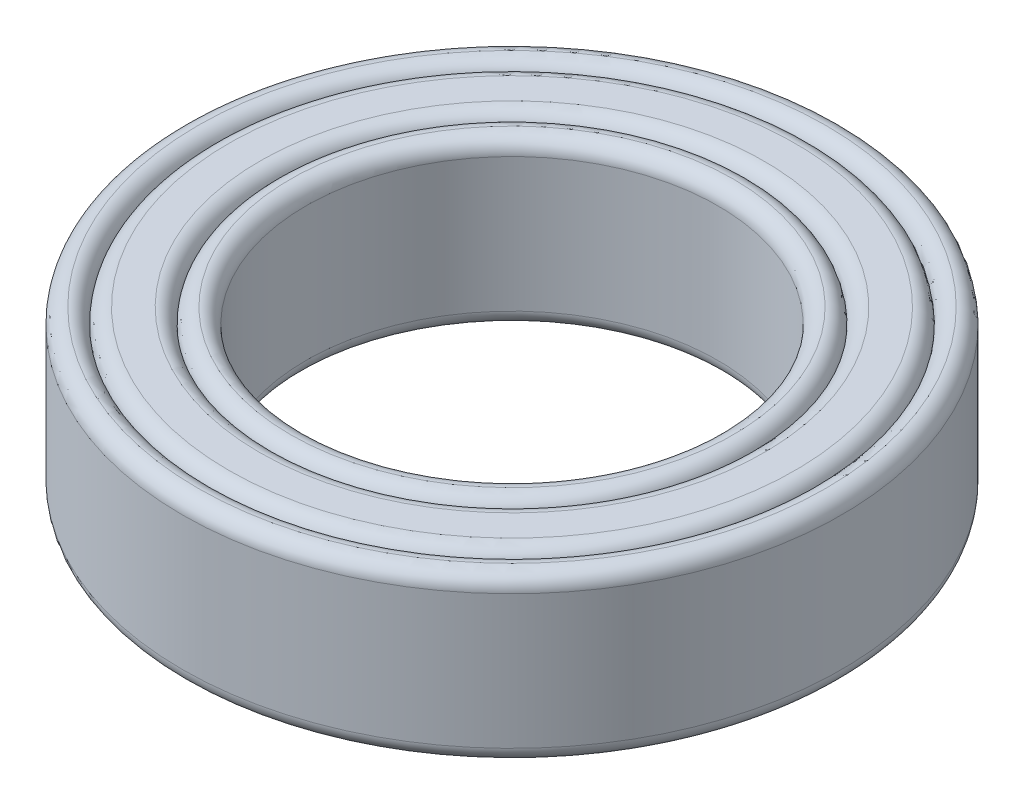
ISO-10303-21;
HEADER;
FILE_DESCRIPTION(('STEP AP214'),'2;1');
FILE_NAME('part.step','',(''),(''),'','','');
FILE_SCHEMA(('AUTOMOTIVE_DESIGN { 1 0 10303 214 1 1 1 1 }'));
ENDSEC;
DATA;
#1=APPLICATION_CONTEXT('core data for automotive mechanical design processes');
#2=APPLICATION_PROTOCOL_DEFINITION('international standard','automotive_design',2000,#1);
#3=PRODUCT_CONTEXT('',#1,'mechanical');
#4=PRODUCT('Part','Part','',(#3));
#5=PRODUCT_RELATED_PRODUCT_CATEGORY('part','',(#4));
#6=PRODUCT_DEFINITION_FORMATION('','',#4);
#7=PRODUCT_DEFINITION_CONTEXT('part definition',#1,'design');
#8=PRODUCT_DEFINITION('design','',#6,#7);
#9=PRODUCT_DEFINITION_SHAPE('','',#8);
#10=(LENGTH_UNIT() NAMED_UNIT(*) SI_UNIT(.MILLI.,.METRE.));
#11=(NAMED_UNIT(*) PLANE_ANGLE_UNIT() SI_UNIT($,.RADIAN.));
#12=(NAMED_UNIT(*) SI_UNIT($,.STERADIAN.) SOLID_ANGLE_UNIT());
#13=UNCERTAINTY_MEASURE_WITH_UNIT(LENGTH_MEASURE(1.E-05),#10,'distance_accuracy_value','');
#14=(GEOMETRIC_REPRESENTATION_CONTEXT(3) GLOBAL_UNCERTAINTY_ASSIGNED_CONTEXT((#13)) GLOBAL_UNIT_ASSIGNED_CONTEXT((#10,
#11,#12)) REPRESENTATION_CONTEXT('',''));
#15=CARTESIAN_POINT('',(0.,0.,0.));
#16=DIRECTION('',(0.,0.,1.));
#17=DIRECTION('',(1.,0.,0.));
#18=AXIS2_PLACEMENT_3D('',#15,#16,#17);
#19=CARTESIAN_POINT('',(0.,2.,0.));
#20=DIRECTION('',(0.,-1.,0.));
#21=DIRECTION('',(0.,0.,-1.));
#22=AXIS2_PLACEMENT_3D('',#19,#20,#21);
#23=CYLINDRICAL_SURFACE('',#22,8.);
#24=CARTESIAN_POINT('',(0.,-1.625,0.));
#25=DIRECTION('',(0.,1.,0.));
#26=DIRECTION('',(0.,0.,1.));
#27=AXIS2_PLACEMENT_3D('',#24,#25,#26);
#28=CIRCLE('',#27,8.);
#29=CARTESIAN_POINT('',(0.,-1.625,8.));
#30=VERTEX_POINT('',#29);
#31=EDGE_CURVE('E83',#30,#30,#28,.T.);
#32=ORIENTED_EDGE('',*,*,#31,.T.);
#33=EDGE_LOOP('',(#32));
#34=FACE_BOUND('',#33,.T.);
#35=CARTESIAN_POINT('',(0.,1.625,0.));
#36=DIRECTION('',(0.,1.,0.));
#37=DIRECTION('',(0.,0.,1.));
#38=AXIS2_PLACEMENT_3D('',#35,#36,#37);
#39=CIRCLE('',#38,8.);
#40=CARTESIAN_POINT('',(0.,1.625,8.));
#41=VERTEX_POINT('',#40);
#42=EDGE_CURVE('E86',#41,#41,#39,.F.);
#43=ORIENTED_EDGE('',*,*,#42,.T.);
#44=EDGE_LOOP('',(#43));
#45=FACE_BOUND('',#44,.T.);
#46=ADVANCED_FACE('F33',(#34,#45),#23,.T.);
#47=CARTESIAN_POINT('',(0.,-1.625,0.));
#48=DIRECTION('',(0.,1.,0.));
#49=DIRECTION('',(0.,0.,1.));
#50=AXIS2_PLACEMENT_3D('',#47,#48,#49);
#51=TOROIDAL_SURFACE('',#50,7.625,0.375);
#52=CARTESIAN_POINT('',(0.,-2.,0.));
#53=DIRECTION('',(0.,1.,0.));
#54=DIRECTION('',(0.,0.,1.));
#55=AXIS2_PLACEMENT_3D('',#52,#53,#54);
#56=CIRCLE('',#55,7.625);
#57=CARTESIAN_POINT('',(0.,-2.,7.625));
#58=VERTEX_POINT('',#57);
#59=EDGE_CURVE('E80',#58,#58,#56,.F.);
#60=ORIENTED_EDGE('',*,*,#59,.F.);
#61=EDGE_LOOP('',(#60));
#62=FACE_BOUND('',#61,.T.);
#63=ORIENTED_EDGE('',*,*,#31,.F.);
#64=EDGE_LOOP('',(#63));
#65=FACE_BOUND('',#64,.T.);
#66=ADVANCED_FACE('F95',(#62,#65),#51,.T.);
#67=CARTESIAN_POINT('',(0.,1.625,0.));
#68=DIRECTION('',(0.,1.,0.));
#69=DIRECTION('',(0.,0.,1.));
#70=AXIS2_PLACEMENT_3D('',#67,#68,#69);
#71=TOROIDAL_SURFACE('',#70,7.625,0.375);
#72=ORIENTED_EDGE('',*,*,#42,.F.);
#73=EDGE_LOOP('',(#72));
#74=FACE_BOUND('',#73,.T.);
#75=CARTESIAN_POINT('',(0.,2.,0.));
#76=DIRECTION('',(0.,1.,0.));
#77=DIRECTION('',(0.,0.,1.));
#78=AXIS2_PLACEMENT_3D('',#75,#76,#77);
#79=CIRCLE('',#78,7.625);
#80=CARTESIAN_POINT('',(0.,2.,7.625));
#81=VERTEX_POINT('',#80);
#82=EDGE_CURVE('E77',#81,#81,#79,.T.);
#83=ORIENTED_EDGE('',*,*,#82,.F.);
#84=EDGE_LOOP('',(#83));
#85=FACE_BOUND('',#84,.T.);
#86=ADVANCED_FACE('F91',(#74,#85),#71,.T.);
#87=CARTESIAN_POINT('',(0.,1.625,0.));
#88=DIRECTION('',(0.,1.,0.));
#89=DIRECTION('',(0.,0.,1.));
#90=AXIS2_PLACEMENT_3D('',#87,#88,#89);
#91=TOROIDAL_SURFACE('',#90,7.625,0.375);
#92=ORIENTED_EDGE('',*,*,#82,.T.);
#93=EDGE_LOOP('',(#92));
#94=FACE_BOUND('',#93,.T.);
#95=CARTESIAN_POINT('',(0.,1.625,0.));
#96=DIRECTION('',(0.,1.,0.));
#97=DIRECTION('',(0.,0.,1.));
#98=AXIS2_PLACEMENT_3D('',#95,#96,#97);
#99=CIRCLE('',#98,7.25);
#100=CARTESIAN_POINT('',(0.,1.625,7.25));
#101=VERTEX_POINT('',#100);
#102=EDGE_CURVE('E71',#101,#101,#99,.T.);
#103=ORIENTED_EDGE('',*,*,#102,.F.);
#104=EDGE_LOOP('',(#103));
#105=FACE_BOUND('',#104,.T.);
#106=ADVANCED_FACE('F94',(#94,#105),#91,.T.);
#107=CARTESIAN_POINT('',(0.,-1.625,0.));
#108=DIRECTION('',(0.,1.,0.));
#109=DIRECTION('',(0.,0.,1.));
#110=AXIS2_PLACEMENT_3D('',#107,#108,#109);
#111=TOROIDAL_SURFACE('',#110,7.625,0.375);
#112=CARTESIAN_POINT('',(0.,-1.625,0.));
#113=DIRECTION('',(0.,1.,0.));
#114=DIRECTION('',(0.,0.,1.));
#115=AXIS2_PLACEMENT_3D('',#112,#113,#114);
#116=CIRCLE('',#115,7.25);
#117=CARTESIAN_POINT('',(0.,-1.625,7.25));
#118=VERTEX_POINT('',#117);
#119=EDGE_CURVE('E74',#118,#118,#116,.F.);
#120=ORIENTED_EDGE('',*,*,#119,.F.);
#121=EDGE_LOOP('',(#120));
#122=FACE_BOUND('',#121,.T.);
#123=ORIENTED_EDGE('',*,*,#59,.T.);
#124=EDGE_LOOP('',(#123));
#125=FACE_BOUND('',#124,.T.);
#126=ADVANCED_FACE('F101',(#122,#125),#111,.T.);
#127=CARTESIAN_POINT('',(0.,-2.,0.));
#128=DIRECTION('',(0.,1.,0.));
#129=DIRECTION('',(0.,0.,1.));
#130=AXIS2_PLACEMENT_3D('',#127,#128,#129);
#131=PLANE('',#130);
#132=CARTESIAN_POINT('',(0.,-2.,0.));
#133=DIRECTION('',(0.,1.,0.));
#134=DIRECTION('',(0.,0.,1.));
#135=AXIS2_PLACEMENT_3D('',#132,#133,#134);
#136=CIRCLE('',#135,6.125);
#137=CARTESIAN_POINT('',(0.,-2.,6.125));
#138=VERTEX_POINT('',#137);
#139=EDGE_CURVE('E53',#138,#138,#136,.T.);
#140=ORIENTED_EDGE('',*,*,#139,.T.);
#141=EDGE_LOOP('',(#140));
#142=FACE_BOUND('',#141,.T.);
#143=CARTESIAN_POINT('',(0.,-2.,0.));
#144=DIRECTION('',(0.,1.,0.));
#145=DIRECTION('',(0.,0.,1.));
#146=AXIS2_PLACEMENT_3D('',#143,#144,#145);
#147=CIRCLE('',#146,6.875);
#148=CARTESIAN_POINT('',(0.,-2.,6.875));
#149=VERTEX_POINT('',#148);
#150=EDGE_CURVE('E68',#149,#149,#147,.F.);
#151=ORIENTED_EDGE('',*,*,#150,.T.);
#152=EDGE_LOOP('',(#151));
#153=FACE_BOUND('',#152,.T.);
#154=ADVANCED_FACE('F115',(#142,#153),#131,.F.);
#155=CARTESIAN_POINT('',(0.,2.,0.));
#156=DIRECTION('',(0.,1.,0.));
#157=DIRECTION('',(0.,0.,1.));
#158=AXIS2_PLACEMENT_3D('',#155,#156,#157);
#159=PLANE('',#158);
#160=CARTESIAN_POINT('',(0.,2.,0.));
#161=DIRECTION('',(0.,1.,0.));
#162=DIRECTION('',(0.,0.,1.));
#163=AXIS2_PLACEMENT_3D('',#160,#161,#162);
#164=CIRCLE('',#163,6.125);
#165=CARTESIAN_POINT('',(0.,2.,6.125));
#166=VERTEX_POINT('',#165);
#167=EDGE_CURVE('E56',#166,#166,#164,.F.);
#168=ORIENTED_EDGE('',*,*,#167,.T.);
#169=EDGE_LOOP('',(#168));
#170=FACE_BOUND('',#169,.T.);
#171=CARTESIAN_POINT('',(0.,2.,0.));
#172=DIRECTION('',(0.,1.,0.));
#173=DIRECTION('',(0.,0.,1.));
#174=AXIS2_PLACEMENT_3D('',#171,#172,#173);
#175=CIRCLE('',#174,6.875);
#176=CARTESIAN_POINT('',(0.,2.,6.875));
#177=VERTEX_POINT('',#176);
#178=EDGE_CURVE('E65',#177,#177,#175,.T.);
#179=ORIENTED_EDGE('',*,*,#178,.T.);
#180=EDGE_LOOP('',(#179));
#181=FACE_BOUND('',#180,.T.);
#182=ADVANCED_FACE('F113',(#170,#181),#159,.T.);
#183=CARTESIAN_POINT('',(0.,-1.625,0.));
#184=DIRECTION('',(0.,1.,0.));
#185=DIRECTION('',(0.,0.,1.));
#186=AXIS2_PLACEMENT_3D('',#183,#184,#185);
#187=TOROIDAL_SURFACE('',#186,6.875,0.375);
#188=ORIENTED_EDGE('',*,*,#150,.F.);
#189=EDGE_LOOP('',(#188));
#190=FACE_BOUND('',#189,.T.);
#191=ORIENTED_EDGE('',*,*,#119,.T.);
#192=EDGE_LOOP('',(#191));
#193=FACE_BOUND('',#192,.T.);
#194=ADVANCED_FACE('F109',(#190,#193),#187,.T.);
#195=CARTESIAN_POINT('',(0.,1.625,0.));
#196=DIRECTION('',(0.,1.,0.));
#197=DIRECTION('',(0.,0.,1.));
#198=AXIS2_PLACEMENT_3D('',#195,#196,#197);
#199=TOROIDAL_SURFACE('',#198,6.875,0.375);
#200=ORIENTED_EDGE('',*,*,#102,.T.);
#201=EDGE_LOOP('',(#200));
#202=FACE_BOUND('',#201,.T.);
#203=ORIENTED_EDGE('',*,*,#178,.F.);
#204=EDGE_LOOP('',(#203));
#205=FACE_BOUND('',#204,.T.);
#206=ADVANCED_FACE('F105',(#202,#205),#199,.T.);
#207=CARTESIAN_POINT('',(0.,1.625,0.));
#208=DIRECTION('',(0.,1.,0.));
#209=DIRECTION('',(0.,0.,1.));
#210=AXIS2_PLACEMENT_3D('',#207,#208,#209);
#211=TOROIDAL_SURFACE('',#210,6.125,0.375);
#212=ORIENTED_EDGE('',*,*,#167,.F.);
#213=EDGE_LOOP('',(#212));
#214=FACE_BOUND('',#213,.T.);
#215=CARTESIAN_POINT('',(0.,1.625,0.));
#216=DIRECTION('',(0.,1.,0.));
#217=DIRECTION('',(0.,0.,1.));
#218=AXIS2_PLACEMENT_3D('',#215,#216,#217);
#219=CIRCLE('',#218,5.75);
#220=CARTESIAN_POINT('',(0.,1.625,5.75));
#221=VERTEX_POINT('',#220);
#222=EDGE_CURVE('E59',#221,#221,#219,.T.);
#223=ORIENTED_EDGE('',*,*,#222,.F.);
#224=EDGE_LOOP('',(#223));
#225=FACE_BOUND('',#224,.T.);
#226=ADVANCED_FACE('F108',(#214,#225),#211,.T.);
#227=CARTESIAN_POINT('',(0.,-1.625,0.));
#228=DIRECTION('',(0.,1.,0.));
#229=DIRECTION('',(0.,0.,1.));
#230=AXIS2_PLACEMENT_3D('',#227,#228,#229);
#231=TOROIDAL_SURFACE('',#230,6.125,0.375);
#232=CARTESIAN_POINT('',(0.,-1.625,0.));
#233=DIRECTION('',(0.,1.,0.));
#234=DIRECTION('',(0.,0.,1.));
#235=AXIS2_PLACEMENT_3D('',#232,#233,#234);
#236=CIRCLE('',#235,5.75);
#237=CARTESIAN_POINT('',(0.,-1.625,5.75));
#238=VERTEX_POINT('',#237);
#239=EDGE_CURVE('E62',#238,#238,#236,.F.);
#240=ORIENTED_EDGE('',*,*,#239,.F.);
#241=EDGE_LOOP('',(#240));
#242=FACE_BOUND('',#241,.T.);
#243=ORIENTED_EDGE('',*,*,#139,.F.);
#244=EDGE_LOOP('',(#243));
#245=FACE_BOUND('',#244,.T.);
#246=ADVANCED_FACE('F140',(#242,#245),#231,.T.);
#247=CARTESIAN_POINT('',(0.,-1.625,0.));
#248=DIRECTION('',(0.,1.,0.));
#249=DIRECTION('',(0.,0.,1.));
#250=AXIS2_PLACEMENT_3D('',#247,#248,#249);
#251=TOROIDAL_SURFACE('',#250,5.375,0.375);
#252=CARTESIAN_POINT('',(0.,-2.,0.));
#253=DIRECTION('',(0.,1.,0.));
#254=DIRECTION('',(0.,0.,1.));
#255=AXIS2_PLACEMENT_3D('',#252,#253,#254);
#256=CIRCLE('',#255,5.375);
#257=CARTESIAN_POINT('',(0.,-2.,5.375));
#258=VERTEX_POINT('',#257);
#259=EDGE_CURVE('E48',#258,#258,#256,.F.);
#260=ORIENTED_EDGE('',*,*,#259,.F.);
#261=EDGE_LOOP('',(#260));
#262=FACE_BOUND('',#261,.T.);
#263=ORIENTED_EDGE('',*,*,#239,.T.);
#264=EDGE_LOOP('',(#263));
#265=FACE_BOUND('',#264,.T.);
#266=ADVANCED_FACE('F144',(#262,#265),#251,.T.);
#267=CARTESIAN_POINT('',(0.,1.625,0.));
#268=DIRECTION('',(0.,1.,0.));
#269=DIRECTION('',(0.,0.,1.));
#270=AXIS2_PLACEMENT_3D('',#267,#268,#269);
#271=TOROIDAL_SURFACE('',#270,5.375,0.375);
#272=ORIENTED_EDGE('',*,*,#222,.T.);
#273=EDGE_LOOP('',(#272));
#274=FACE_BOUND('',#273,.T.);
#275=CARTESIAN_POINT('',(0.,2.,0.));
#276=DIRECTION('',(0.,1.,0.));
#277=DIRECTION('',(0.,0.,1.));
#278=AXIS2_PLACEMENT_3D('',#275,#276,#277);
#279=CIRCLE('',#278,5.375);
#280=CARTESIAN_POINT('',(0.,2.,5.375));
#281=VERTEX_POINT('',#280);
#282=EDGE_CURVE('E44',#281,#281,#279,.T.);
#283=ORIENTED_EDGE('',*,*,#282,.F.);
#284=EDGE_LOOP('',(#283));
#285=FACE_BOUND('',#284,.T.);
#286=ADVANCED_FACE('F148',(#274,#285),#271,.T.);
#287=CARTESIAN_POINT('',(0.,-2.,0.));
#288=DIRECTION('',(0.,1.,0.));
#289=DIRECTION('',(0.,0.,1.));
#290=AXIS2_PLACEMENT_3D('',#287,#288,#289);
#291=CYLINDRICAL_SURFACE('',#290,5.);
#292=CARTESIAN_POINT('',(0.,1.625,0.));
#293=DIRECTION('',(0.,1.,0.));
#294=DIRECTION('',(0.,0.,1.));
#295=AXIS2_PLACEMENT_3D('',#292,#293,#294);
#296=CIRCLE('',#295,5.);
#297=CARTESIAN_POINT('',(0.,1.625,5.));
#298=VERTEX_POINT('',#297);
#299=EDGE_CURVE('E10',#298,#298,#296,.T.);
#300=ORIENTED_EDGE('',*,*,#299,.T.);
#301=EDGE_LOOP('',(#300));
#302=FACE_BOUND('',#301,.T.);
#303=CARTESIAN_POINT('',(0.,-1.625,0.));
#304=DIRECTION('',(0.,1.,0.));
#305=DIRECTION('',(0.,0.,1.));
#306=AXIS2_PLACEMENT_3D('',#303,#304,#305);
#307=CIRCLE('',#306,5.);
#308=CARTESIAN_POINT('',(0.,-1.625,5.));
#309=VERTEX_POINT('',#308);
#310=EDGE_CURVE('E40',#309,#309,#307,.F.);
#311=ORIENTED_EDGE('',*,*,#310,.T.);
#312=EDGE_LOOP('',(#311));
#313=FACE_BOUND('',#312,.T.);
#314=ADVANCED_FACE('F151',(#302,#313),#291,.F.);
#315=CARTESIAN_POINT('',(0.,1.625,0.));
#316=DIRECTION('',(0.,1.,0.));
#317=DIRECTION('',(0.,0.,1.));
#318=AXIS2_PLACEMENT_3D('',#315,#316,#317);
#319=TOROIDAL_SURFACE('',#318,5.375,0.375);
#320=ORIENTED_EDGE('',*,*,#282,.T.);
#321=EDGE_LOOP('',(#320));
#322=FACE_BOUND('',#321,.T.);
#323=ORIENTED_EDGE('',*,*,#299,.F.);
#324=EDGE_LOOP('',(#323));
#325=FACE_BOUND('',#324,.T.);
#326=ADVANCED_FACE('F153',(#322,#325),#319,.T.);
#327=CARTESIAN_POINT('',(0.,-1.625,0.));
#328=DIRECTION('',(0.,1.,0.));
#329=DIRECTION('',(0.,0.,1.));
#330=AXIS2_PLACEMENT_3D('',#327,#328,#329);
#331=TOROIDAL_SURFACE('',#330,5.375,0.375);
#332=ORIENTED_EDGE('',*,*,#310,.F.);
#333=EDGE_LOOP('',(#332));
#334=FACE_BOUND('',#333,.T.);
#335=ORIENTED_EDGE('',*,*,#259,.T.);
#336=EDGE_LOOP('',(#335));
#337=FACE_BOUND('',#336,.T.);
#338=ADVANCED_FACE('F35',(#334,#337),#331,.T.);
#339=CLOSED_SHELL('',(#46,#66,#86,#106,#126,#154,#182,#194,#206,#226,#246,#266,#286,#314,#326,#338));
#340=MANIFOLD_SOLID_BREP('B2',#339);
#341=ADVANCED_BREP_SHAPE_REPRESENTATION('',(#18,#340),#14);
#342=SHAPE_DEFINITION_REPRESENTATION(#9,#341);
ENDSEC;
END-ISO-10303-21;
